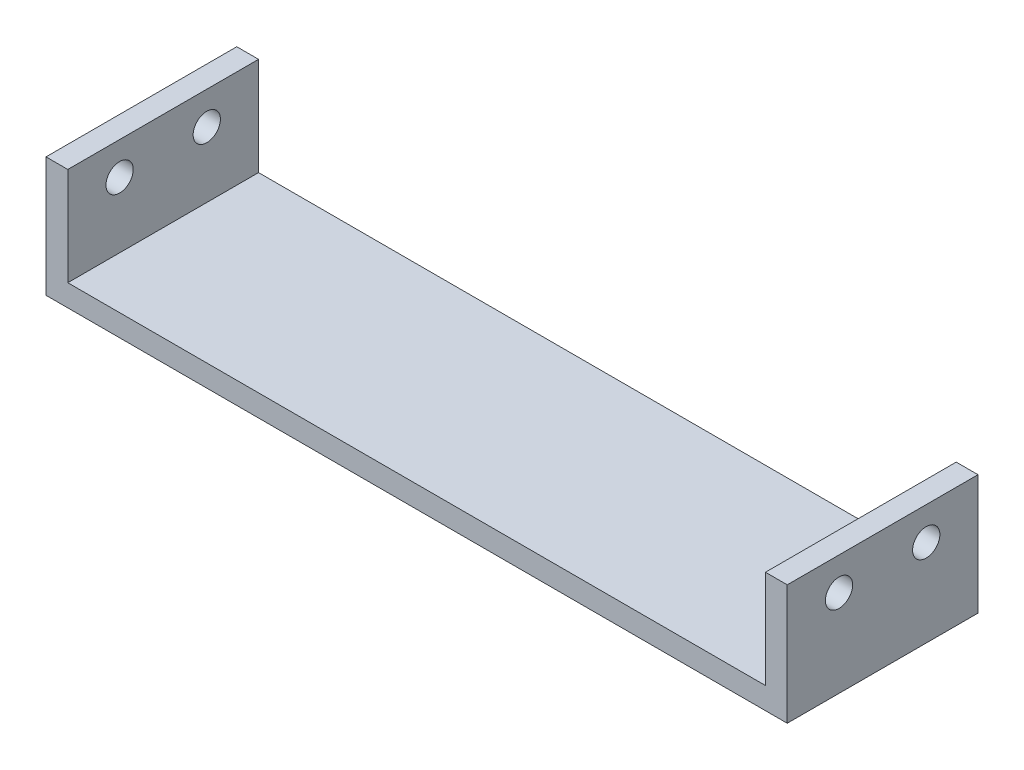
ISO-10303-21;
HEADER;
FILE_DESCRIPTION(('STEP AP214'),'2;1');
FILE_NAME('part.step','',(''),(''),'','','');
FILE_SCHEMA(('AUTOMOTIVE_DESIGN { 1 0 10303 214 1 1 1 1 }'));
ENDSEC;
DATA;
#1=APPLICATION_CONTEXT('core data for automotive mechanical design processes');
#2=APPLICATION_PROTOCOL_DEFINITION('international standard','automotive_design',2000,#1);
#3=PRODUCT_CONTEXT('',#1,'mechanical');
#4=PRODUCT('Part','Part','',(#3));
#5=PRODUCT_RELATED_PRODUCT_CATEGORY('part','',(#4));
#6=PRODUCT_DEFINITION_FORMATION('','',#4);
#7=PRODUCT_DEFINITION_CONTEXT('part definition',#1,'design');
#8=PRODUCT_DEFINITION('design','',#6,#7);
#9=PRODUCT_DEFINITION_SHAPE('','',#8);
#10=(LENGTH_UNIT() NAMED_UNIT(*) SI_UNIT(.MILLI.,.METRE.));
#11=(NAMED_UNIT(*) PLANE_ANGLE_UNIT() SI_UNIT($,.RADIAN.));
#12=(NAMED_UNIT(*) SI_UNIT($,.STERADIAN.) SOLID_ANGLE_UNIT());
#13=UNCERTAINTY_MEASURE_WITH_UNIT(LENGTH_MEASURE(1.E-05),#10,'distance_accuracy_value','');
#14=(GEOMETRIC_REPRESENTATION_CONTEXT(3) GLOBAL_UNCERTAINTY_ASSIGNED_CONTEXT((#13)) GLOBAL_UNIT_ASSIGNED_CONTEXT((#10,
#11,#12)) REPRESENTATION_CONTEXT('',''));
#15=CARTESIAN_POINT('',(0.,0.,0.));
#16=DIRECTION('',(0.,0.,1.));
#17=DIRECTION('',(1.,0.,0.));
#18=AXIS2_PLACEMENT_3D('',#15,#16,#17);
#19=CARTESIAN_POINT('',(2.,0.,0.));
#20=DIRECTION('',(-1.,0.,0.));
#21=DIRECTION('',(0.,0.,1.));
#22=AXIS2_PLACEMENT_3D('',#19,#20,#21);
#23=PLANE('',#22);
#24=CARTESIAN_POINT('',(2.,6.04,44.0143510815308));
#25=DIRECTION('',(-1.,0.,0.));
#26=DIRECTION('',(0.,0.,1.));
#27=AXIS2_PLACEMENT_3D('',#24,#25,#26);
#28=CIRCLE('',#27,1.25);
#29=CARTESIAN_POINT('',(2.,6.04,45.2643510815308));
#30=VERTEX_POINT('',#29);
#31=EDGE_CURVE('E143',#30,#30,#28,.T.);
#32=ORIENTED_EDGE('',*,*,#31,.T.);
#33=EDGE_LOOP('',(#32));
#34=FACE_BOUND('',#33,.T.);
#35=CARTESIAN_POINT('',(2.,6.04,52.0143510815308));
#36=DIRECTION('',(-1.,0.,0.));
#37=DIRECTION('',(0.,0.,1.));
#38=AXIS2_PLACEMENT_3D('',#35,#36,#37);
#39=CIRCLE('',#38,1.25);
#40=CARTESIAN_POINT('',(2.,6.04,53.2643510815308));
#41=VERTEX_POINT('',#40);
#42=EDGE_CURVE('E130',#41,#41,#39,.T.);
#43=ORIENTED_EDGE('',*,*,#42,.T.);
#44=EDGE_LOOP('',(#43));
#45=FACE_BOUND('',#44,.T.);
#46=DIRECTION('',(0.,0.,1.));
#47=VECTOR('',#46,1.);
#48=CARTESIAN_POINT('',(2.,0.0400000000000001,56.7643510815308));
#49=LINE('',#48,#47);
#50=CARTESIAN_POINT('',(2.,0.0400000000000001,39.2643510815308));
#51=VERTEX_POINT('',#50);
#52=CARTESIAN_POINT('',(2.,0.0400000000000001,56.7643510815308));
#53=VERTEX_POINT('',#52);
#54=EDGE_CURVE('E49',#51,#53,#49,.T.);
#55=ORIENTED_EDGE('',*,*,#54,.F.);
#56=DIRECTION('',(0.,1.,0.));
#57=VECTOR('',#56,1.);
#58=CARTESIAN_POINT('',(2.,-1.96,39.2643510815308));
#59=LINE('',#58,#57);
#60=CARTESIAN_POINT('',(2.,9.04,39.2643510815308));
#61=VERTEX_POINT('',#60);
#62=EDGE_CURVE('E110',#51,#61,#59,.T.);
#63=ORIENTED_EDGE('',*,*,#62,.T.);
#64=DIRECTION('',(0.,0.,1.));
#65=VECTOR('',#64,1.);
#66=CARTESIAN_POINT('',(2.,9.04,56.7643510815308));
#67=LINE('',#66,#65);
#68=CARTESIAN_POINT('',(2.,9.04,56.7643510815308));
#69=VERTEX_POINT('',#68);
#70=EDGE_CURVE('E55',#61,#69,#67,.T.);
#71=ORIENTED_EDGE('',*,*,#70,.T.);
#72=DIRECTION('',(0.,-1.,0.));
#73=VECTOR('',#72,1.);
#74=CARTESIAN_POINT('',(2.,-1.96,56.7643510815308));
#75=LINE('',#74,#73);
#76=EDGE_CURVE('E84',#69,#53,#75,.T.);
#77=ORIENTED_EDGE('',*,*,#76,.T.);
#78=EDGE_LOOP('',(#55,#63,#71,#77));
#79=FACE_BOUND('',#78,.T.);
#80=ADVANCED_FACE('F32',(#34,#45,#79),#23,.F.);
#81=CARTESIAN_POINT('',(2.,-1.96,56.7643510815308));
#82=DIRECTION('',(0.,0.,-1.));
#83=DIRECTION('',(-1.,0.,0.));
#84=AXIS2_PLACEMENT_3D('',#81,#82,#83);
#85=PLANE('',#84);
#86=DIRECTION('',(0.,-1.,0.));
#87=VECTOR('',#86,1.);
#88=CARTESIAN_POINT('',(0.,-1.96,56.7643510815308));
#89=LINE('',#88,#87);
#90=CARTESIAN_POINT('',(0.,9.04,56.7643510815308));
#91=VERTEX_POINT('',#90);
#92=CARTESIAN_POINT('',(0.,-1.96,56.7643510815308));
#93=VERTEX_POINT('',#92);
#94=EDGE_CURVE('E90',#91,#93,#89,.T.);
#95=ORIENTED_EDGE('',*,*,#94,.T.);
#96=DIRECTION('',(-1.,0.,0.));
#97=VECTOR('',#96,1.);
#98=CARTESIAN_POINT('',(2.,-1.96,56.7643510815308));
#99=LINE('',#98,#97);
#100=CARTESIAN_POINT('',(68.,-1.96,56.7643510815308));
#101=VERTEX_POINT('',#100);
#102=EDGE_CURVE('E11',#101,#93,#99,.T.);
#103=ORIENTED_EDGE('',*,*,#102,.F.);
#104=DIRECTION('',(0.,-1.,0.));
#105=VECTOR('',#104,1.);
#106=CARTESIAN_POINT('',(68.,-1.96,56.7643510815308));
#107=LINE('',#106,#105);
#108=CARTESIAN_POINT('',(68.,9.04,56.7643510815308));
#109=VERTEX_POINT('',#108);
#110=EDGE_CURVE('E148',#109,#101,#107,.T.);
#111=ORIENTED_EDGE('',*,*,#110,.F.);
#112=DIRECTION('',(-1.,0.,0.));
#113=VECTOR('',#112,1.);
#114=CARTESIAN_POINT('',(68.,9.04,56.7643510815308));
#115=LINE('',#114,#113);
#116=CARTESIAN_POINT('',(66.,9.04,56.7643510815308));
#117=VERTEX_POINT('',#116);
#118=EDGE_CURVE('E161',#109,#117,#115,.T.);
#119=ORIENTED_EDGE('',*,*,#118,.T.);
#120=DIRECTION('',(0.,-1.,0.));
#121=VECTOR('',#120,1.);
#122=CARTESIAN_POINT('',(66.,-1.96,56.7643510815308));
#123=LINE('',#122,#121);
#124=CARTESIAN_POINT('',(66.,0.0400000000000001,56.7643510815308));
#125=VERTEX_POINT('',#124);
#126=EDGE_CURVE('E135',#117,#125,#123,.T.);
#127=ORIENTED_EDGE('',*,*,#126,.T.);
#128=DIRECTION('',(-1.,0.,0.));
#129=VECTOR('',#128,1.);
#130=CARTESIAN_POINT('',(66.,0.0400000000000001,56.7643510815308));
#131=LINE('',#130,#129);
#132=EDGE_CURVE('E99',#125,#53,#131,.T.);
#133=ORIENTED_EDGE('',*,*,#132,.T.);
#134=ORIENTED_EDGE('',*,*,#76,.F.);
#135=DIRECTION('',(-1.,0.,0.));
#136=VECTOR('',#135,1.);
#137=CARTESIAN_POINT('',(2.,9.04,56.7643510815308));
#138=LINE('',#137,#136);
#139=EDGE_CURVE('E77',#69,#91,#138,.T.);
#140=ORIENTED_EDGE('',*,*,#139,.T.);
#141=EDGE_LOOP('',(#95,#103,#111,#119,#127,#133,#134,#140));
#142=FACE_BOUND('',#141,.T.);
#143=ADVANCED_FACE('F34',(#142),#85,.F.);
#144=CARTESIAN_POINT('',(2.,-1.96,56.7643510815308));
#145=DIRECTION('',(0.,1.,0.));
#146=DIRECTION('',(0.,0.,1.));
#147=AXIS2_PLACEMENT_3D('',#144,#145,#146);
#148=PLANE('',#147);
#149=DIRECTION('',(0.,0.,-1.));
#150=VECTOR('',#149,1.);
#151=CARTESIAN_POINT('',(0.,-1.96,56.7643510815308));
#152=LINE('',#151,#150);
#153=CARTESIAN_POINT('',(0.,-1.96,39.2643510815308));
#154=VERTEX_POINT('',#153);
#155=EDGE_CURVE('E94',#93,#154,#152,.T.);
#156=ORIENTED_EDGE('',*,*,#155,.T.);
#157=DIRECTION('',(-1.,0.,0.));
#158=VECTOR('',#157,1.);
#159=CARTESIAN_POINT('',(2.,-1.96,39.2643510815308));
#160=LINE('',#159,#158);
#161=CARTESIAN_POINT('',(68.,-1.96,39.2643510815308));
#162=VERTEX_POINT('',#161);
#163=EDGE_CURVE('E41',#162,#154,#160,.T.);
#164=ORIENTED_EDGE('',*,*,#163,.F.);
#165=DIRECTION('',(0.,0.,-1.));
#166=VECTOR('',#165,1.);
#167=CARTESIAN_POINT('',(68.,-1.96,56.7643510815308));
#168=LINE('',#167,#166);
#169=EDGE_CURVE('E151',#101,#162,#168,.T.);
#170=ORIENTED_EDGE('',*,*,#169,.F.);
#171=ORIENTED_EDGE('',*,*,#102,.T.);
#172=EDGE_LOOP('',(#156,#164,#170,#171));
#173=FACE_BOUND('',#172,.T.);
#174=ADVANCED_FACE('F222',(#173),#148,.F.);
#175=CARTESIAN_POINT('',(2.,-1.96,39.2643510815308));
#176=DIRECTION('',(0.,0.,1.));
#177=DIRECTION('',(1.,0.,0.));
#178=AXIS2_PLACEMENT_3D('',#175,#176,#177);
#179=PLANE('',#178);
#180=DIRECTION('',(0.,1.,0.));
#181=VECTOR('',#180,1.);
#182=CARTESIAN_POINT('',(0.,-1.96,39.2643510815308));
#183=LINE('',#182,#181);
#184=CARTESIAN_POINT('',(0.,9.04,39.2643510815308));
#185=VERTEX_POINT('',#184);
#186=EDGE_CURVE('E85',#154,#185,#183,.T.);
#187=ORIENTED_EDGE('',*,*,#186,.T.);
#188=DIRECTION('',(-1.,0.,0.));
#189=VECTOR('',#188,1.);
#190=CARTESIAN_POINT('',(2.,9.04,39.2643510815308));
#191=LINE('',#190,#189);
#192=EDGE_CURVE('E80',#61,#185,#191,.T.);
#193=ORIENTED_EDGE('',*,*,#192,.F.);
#194=ORIENTED_EDGE('',*,*,#62,.F.);
#195=DIRECTION('',(-1.,0.,0.));
#196=VECTOR('',#195,1.);
#197=CARTESIAN_POINT('',(66.,0.0400000000000001,39.2643510815308));
#198=LINE('',#197,#196);
#199=CARTESIAN_POINT('',(66.,0.0400000000000001,39.2643510815308));
#200=VERTEX_POINT('',#199);
#201=EDGE_CURVE('E95',#200,#51,#198,.T.);
#202=ORIENTED_EDGE('',*,*,#201,.F.);
#203=DIRECTION('',(0.,1.,0.));
#204=VECTOR('',#203,1.);
#205=CARTESIAN_POINT('',(66.,-1.96,39.2643510815308));
#206=LINE('',#205,#204);
#207=CARTESIAN_POINT('',(66.,9.04,39.2643510815308));
#208=VERTEX_POINT('',#207);
#209=EDGE_CURVE('E169',#200,#208,#206,.T.);
#210=ORIENTED_EDGE('',*,*,#209,.T.);
#211=DIRECTION('',(-1.,0.,0.));
#212=VECTOR('',#211,1.);
#213=CARTESIAN_POINT('',(68.,9.04,39.2643510815308));
#214=LINE('',#213,#212);
#215=CARTESIAN_POINT('',(68.,9.04,39.2643510815308));
#216=VERTEX_POINT('',#215);
#217=EDGE_CURVE('E121',#216,#208,#214,.T.);
#218=ORIENTED_EDGE('',*,*,#217,.F.);
#219=DIRECTION('',(0.,1.,0.));
#220=VECTOR('',#219,1.);
#221=CARTESIAN_POINT('',(68.,-1.96,39.2643510815308));
#222=LINE('',#221,#220);
#223=EDGE_CURVE('E155',#162,#216,#222,.T.);
#224=ORIENTED_EDGE('',*,*,#223,.F.);
#225=ORIENTED_EDGE('',*,*,#163,.T.);
#226=EDGE_LOOP('',(#187,#193,#194,#202,#210,#218,#224,#225));
#227=FACE_BOUND('',#226,.T.);
#228=ADVANCED_FACE('F204',(#227),#179,.F.);
#229=CARTESIAN_POINT('',(2.,9.04,56.7643510815308));
#230=DIRECTION('',(0.,-1.,0.));
#231=DIRECTION('',(0.,0.,-1.));
#232=AXIS2_PLACEMENT_3D('',#229,#230,#231);
#233=PLANE('',#232);
#234=DIRECTION('',(0.,0.,1.));
#235=VECTOR('',#234,1.);
#236=CARTESIAN_POINT('',(0.,9.04,56.7643510815308));
#237=LINE('',#236,#235);
#238=EDGE_CURVE('E74',#185,#91,#237,.T.);
#239=ORIENTED_EDGE('',*,*,#238,.T.);
#240=ORIENTED_EDGE('',*,*,#139,.F.);
#241=ORIENTED_EDGE('',*,*,#70,.F.);
#242=ORIENTED_EDGE('',*,*,#192,.T.);
#243=EDGE_LOOP('',(#239,#240,#241,#242));
#244=FACE_BOUND('',#243,.T.);
#245=ADVANCED_FACE('F76',(#244),#233,.F.);
#246=CARTESIAN_POINT('',(0.,0.,0.));
#247=DIRECTION('',(-1.,0.,0.));
#248=DIRECTION('',(0.,0.,1.));
#249=AXIS2_PLACEMENT_3D('',#246,#247,#248);
#250=PLANE('',#249);
#251=CARTESIAN_POINT('',(0.,6.04,44.0143510815308));
#252=DIRECTION('',(1.,0.,0.));
#253=DIRECTION('',(0.,0.,-1.));
#254=AXIS2_PLACEMENT_3D('',#251,#252,#253);
#255=CIRCLE('',#254,1.25);
#256=CARTESIAN_POINT('',(0.,6.04,42.7643510815308));
#257=VERTEX_POINT('',#256);
#258=EDGE_CURVE('E270',#257,#257,#255,.T.);
#259=ORIENTED_EDGE('',*,*,#258,.T.);
#260=EDGE_LOOP('',(#259));
#261=FACE_BOUND('',#260,.T.);
#262=CARTESIAN_POINT('',(0.,6.04,52.0143510815308));
#263=DIRECTION('',(1.,0.,0.));
#264=DIRECTION('',(0.,0.,-1.));
#265=AXIS2_PLACEMENT_3D('',#262,#263,#264);
#266=CIRCLE('',#265,1.25);
#267=CARTESIAN_POINT('',(0.,6.04,50.7643510815308));
#268=VERTEX_POINT('',#267);
#269=EDGE_CURVE('E131',#268,#268,#266,.T.);
#270=ORIENTED_EDGE('',*,*,#269,.T.);
#271=EDGE_LOOP('',(#270));
#272=FACE_BOUND('',#271,.T.);
#273=ORIENTED_EDGE('',*,*,#94,.F.);
#274=ORIENTED_EDGE('',*,*,#238,.F.);
#275=ORIENTED_EDGE('',*,*,#186,.F.);
#276=ORIENTED_EDGE('',*,*,#155,.F.);
#277=EDGE_LOOP('',(#273,#274,#275,#276));
#278=FACE_BOUND('',#277,.T.);
#279=ADVANCED_FACE('F93',(#261,#272,#278),#250,.T.);
#280=CARTESIAN_POINT('',(66.,0.0400000000000001,56.7643510815308));
#281=DIRECTION('',(0.,-1.,0.));
#282=DIRECTION('',(0.,0.,-1.));
#283=AXIS2_PLACEMENT_3D('',#280,#281,#282);
#284=PLANE('',#283);
#285=ORIENTED_EDGE('',*,*,#54,.T.);
#286=ORIENTED_EDGE('',*,*,#132,.F.);
#287=DIRECTION('',(0.,0.,1.));
#288=VECTOR('',#287,1.);
#289=CARTESIAN_POINT('',(66.,0.0400000000000001,56.7643510815308));
#290=LINE('',#289,#288);
#291=EDGE_CURVE('E120',#200,#125,#290,.T.);
#292=ORIENTED_EDGE('',*,*,#291,.F.);
#293=ORIENTED_EDGE('',*,*,#201,.T.);
#294=EDGE_LOOP('',(#285,#286,#292,#293));
#295=FACE_BOUND('',#294,.T.);
#296=ADVANCED_FACE('F205',(#295),#284,.F.);
#297=CARTESIAN_POINT('',(68.,9.04,56.7643510815308));
#298=DIRECTION('',(0.,-1.,0.));
#299=DIRECTION('',(0.,0.,-1.));
#300=AXIS2_PLACEMENT_3D('',#297,#298,#299);
#301=PLANE('',#300);
#302=DIRECTION('',(0.,0.,1.));
#303=VECTOR('',#302,1.);
#304=CARTESIAN_POINT('',(66.,9.04,56.7643510815308));
#305=LINE('',#304,#303);
#306=EDGE_CURVE('E152',#208,#117,#305,.T.);
#307=ORIENTED_EDGE('',*,*,#306,.T.);
#308=ORIENTED_EDGE('',*,*,#118,.F.);
#309=DIRECTION('',(0.,0.,1.));
#310=VECTOR('',#309,1.);
#311=CARTESIAN_POINT('',(68.,9.04,56.7643510815308));
#312=LINE('',#311,#310);
#313=EDGE_CURVE('E158',#216,#109,#312,.T.);
#314=ORIENTED_EDGE('',*,*,#313,.F.);
#315=ORIENTED_EDGE('',*,*,#217,.T.);
#316=EDGE_LOOP('',(#307,#308,#314,#315));
#317=FACE_BOUND('',#316,.T.);
#318=ADVANCED_FACE('F187',(#317),#301,.F.);
#319=CARTESIAN_POINT('',(68.,0.,0.));
#320=DIRECTION('',(-1.,0.,0.));
#321=DIRECTION('',(0.,0.,1.));
#322=AXIS2_PLACEMENT_3D('',#319,#320,#321);
#323=PLANE('',#322);
#324=CARTESIAN_POINT('',(68.,6.04,44.0143510815308));
#325=DIRECTION('',(1.,0.,0.));
#326=DIRECTION('',(0.,0.,-1.));
#327=AXIS2_PLACEMENT_3D('',#324,#325,#326);
#328=CIRCLE('',#327,1.25);
#329=CARTESIAN_POINT('',(68.,6.04,42.7643510815308));
#330=VERTEX_POINT('',#329);
#331=EDGE_CURVE('E269',#330,#330,#328,.T.);
#332=ORIENTED_EDGE('',*,*,#331,.F.);
#333=EDGE_LOOP('',(#332));
#334=FACE_BOUND('',#333,.T.);
#335=CARTESIAN_POINT('',(68.,6.04,52.0143510815308));
#336=DIRECTION('',(1.,0.,0.));
#337=DIRECTION('',(0.,0.,-1.));
#338=AXIS2_PLACEMENT_3D('',#335,#336,#337);
#339=CIRCLE('',#338,1.25);
#340=CARTESIAN_POINT('',(68.,6.04,50.7643510815308));
#341=VERTEX_POINT('',#340);
#342=EDGE_CURVE('E138',#341,#341,#339,.T.);
#343=ORIENTED_EDGE('',*,*,#342,.F.);
#344=EDGE_LOOP('',(#343));
#345=FACE_BOUND('',#344,.T.);
#346=ORIENTED_EDGE('',*,*,#110,.T.);
#347=ORIENTED_EDGE('',*,*,#169,.T.);
#348=ORIENTED_EDGE('',*,*,#223,.T.);
#349=ORIENTED_EDGE('',*,*,#313,.T.);
#350=EDGE_LOOP('',(#346,#347,#348,#349));
#351=FACE_BOUND('',#350,.T.);
#352=ADVANCED_FACE('F212',(#334,#345,#351),#323,.F.);
#353=CARTESIAN_POINT('',(66.,0.,0.));
#354=DIRECTION('',(-1.,0.,0.));
#355=DIRECTION('',(0.,0.,1.));
#356=AXIS2_PLACEMENT_3D('',#353,#354,#355);
#357=PLANE('',#356);
#358=CARTESIAN_POINT('',(66.,6.04,44.0143510815308));
#359=DIRECTION('',(-1.,0.,0.));
#360=DIRECTION('',(0.,0.,1.));
#361=AXIS2_PLACEMENT_3D('',#358,#359,#360);
#362=CIRCLE('',#361,1.25);
#363=CARTESIAN_POINT('',(66.,6.04,45.2643510815308));
#364=VERTEX_POINT('',#363);
#365=EDGE_CURVE('E36',#364,#364,#362,.T.);
#366=ORIENTED_EDGE('',*,*,#365,.F.);
#367=EDGE_LOOP('',(#366));
#368=FACE_BOUND('',#367,.T.);
#369=CARTESIAN_POINT('',(66.,6.04,52.0143510815308));
#370=DIRECTION('',(-1.,0.,0.));
#371=DIRECTION('',(0.,0.,1.));
#372=AXIS2_PLACEMENT_3D('',#369,#370,#371);
#373=CIRCLE('',#372,1.25);
#374=CARTESIAN_POINT('',(66.,6.04,53.2643510815308));
#375=VERTEX_POINT('',#374);
#376=EDGE_CURVE('E128',#375,#375,#373,.T.);
#377=ORIENTED_EDGE('',*,*,#376,.F.);
#378=EDGE_LOOP('',(#377));
#379=FACE_BOUND('',#378,.T.);
#380=ORIENTED_EDGE('',*,*,#209,.F.);
#381=ORIENTED_EDGE('',*,*,#291,.T.);
#382=ORIENTED_EDGE('',*,*,#126,.F.);
#383=ORIENTED_EDGE('',*,*,#306,.F.);
#384=EDGE_LOOP('',(#380,#381,#382,#383));
#385=FACE_BOUND('',#384,.T.);
#386=ADVANCED_FACE('F192',(#368,#379,#385),#357,.T.);
#387=CARTESIAN_POINT('',(0.,6.04,52.0143510815308));
#388=DIRECTION('',(1.,0.,0.));
#389=DIRECTION('',(0.,0.,-1.));
#390=AXIS2_PLACEMENT_3D('',#387,#388,#389);
#391=CYLINDRICAL_SURFACE('',#390,1.25);
#392=ORIENTED_EDGE('',*,*,#376,.T.);
#393=EDGE_LOOP('',(#392));
#394=FACE_BOUND('',#393,.T.);
#395=ORIENTED_EDGE('',*,*,#342,.T.);
#396=EDGE_LOOP('',(#395));
#397=FACE_BOUND('',#396,.T.);
#398=ADVANCED_FACE('F246',(#394,#397),#391,.F.);
#399=ORIENTED_EDGE('',*,*,#269,.F.);
#400=EDGE_LOOP('',(#399));
#401=FACE_BOUND('',#400,.T.);
#402=ORIENTED_EDGE('',*,*,#42,.F.);
#403=EDGE_LOOP('',(#402));
#404=FACE_BOUND('',#403,.T.);
#405=ADVANCED_FACE('F254',(#401,#404),#391,.F.);
#406=CARTESIAN_POINT('',(0.,6.04,44.0143510815308));
#407=DIRECTION('',(1.,0.,0.));
#408=DIRECTION('',(0.,0.,-1.));
#409=AXIS2_PLACEMENT_3D('',#406,#407,#408);
#410=CYLINDRICAL_SURFACE('',#409,1.25);
#411=ORIENTED_EDGE('',*,*,#365,.T.);
#412=EDGE_LOOP('',(#411));
#413=FACE_BOUND('',#412,.T.);
#414=ORIENTED_EDGE('',*,*,#331,.T.);
#415=EDGE_LOOP('',(#414));
#416=FACE_BOUND('',#415,.T.);
#417=ADVANCED_FACE('F255',(#413,#416),#410,.F.);
#418=ORIENTED_EDGE('',*,*,#258,.F.);
#419=EDGE_LOOP('',(#418));
#420=FACE_BOUND('',#419,.T.);
#421=ORIENTED_EDGE('',*,*,#31,.F.);
#422=EDGE_LOOP('',(#421));
#423=FACE_BOUND('',#422,.T.);
#424=ADVANCED_FACE('F257',(#420,#423),#410,.F.);
#425=CLOSED_SHELL('',(#80,#143,#174,#228,#245,#279,#296,#318,#352,#386,#398,#405,#417,#424));
#426=MANIFOLD_SOLID_BREP('B2',#425);
#427=ADVANCED_BREP_SHAPE_REPRESENTATION('',(#18,#426),#14);
#428=SHAPE_DEFINITION_REPRESENTATION(#9,#427);
ENDSEC;
END-ISO-10303-21;
